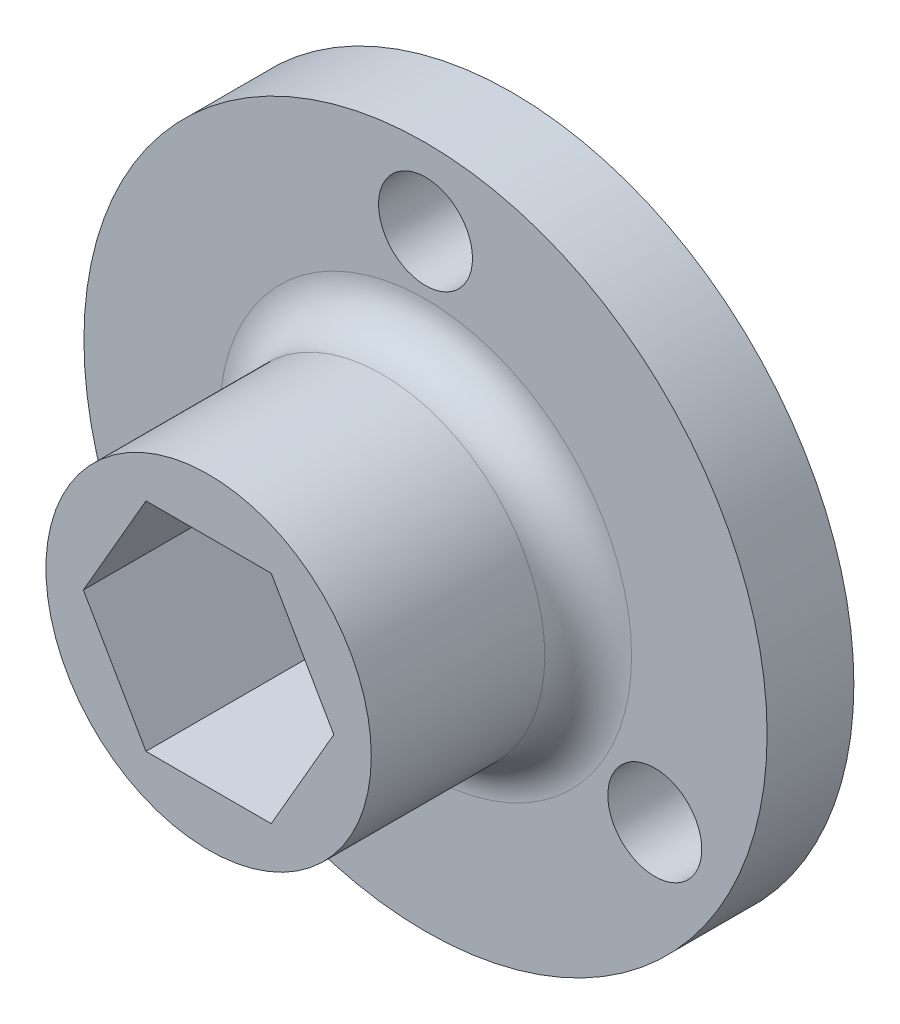
ISO-10303-21;
HEADER;
FILE_DESCRIPTION(('STEP AP214'),'2;1');
FILE_NAME('part.step','',(''),(''),'','','');
FILE_SCHEMA(('AUTOMOTIVE_DESIGN { 1 0 10303 214 1 1 1 1 }'));
ENDSEC;
DATA;
#1=APPLICATION_CONTEXT('core data for automotive mechanical design processes');
#2=APPLICATION_PROTOCOL_DEFINITION('international standard','automotive_design',2000,#1);
#3=PRODUCT_CONTEXT('',#1,'mechanical');
#4=PRODUCT('Part','Part','',(#3));
#5=PRODUCT_RELATED_PRODUCT_CATEGORY('part','',(#4));
#6=PRODUCT_DEFINITION_FORMATION('','',#4);
#7=PRODUCT_DEFINITION_CONTEXT('part definition',#1,'design');
#8=PRODUCT_DEFINITION('design','',#6,#7);
#9=PRODUCT_DEFINITION_SHAPE('','',#8);
#10=(LENGTH_UNIT() NAMED_UNIT(*) SI_UNIT(.MILLI.,.METRE.));
#11=(NAMED_UNIT(*) PLANE_ANGLE_UNIT() SI_UNIT($,.RADIAN.));
#12=(NAMED_UNIT(*) SI_UNIT($,.STERADIAN.) SOLID_ANGLE_UNIT());
#13=UNCERTAINTY_MEASURE_WITH_UNIT(LENGTH_MEASURE(1.E-05),#10,'distance_accuracy_value','');
#14=(GEOMETRIC_REPRESENTATION_CONTEXT(3) GLOBAL_UNCERTAINTY_ASSIGNED_CONTEXT((#13)) GLOBAL_UNIT_ASSIGNED_CONTEXT((#10,
#11,#12)) REPRESENTATION_CONTEXT('',''));
#15=CARTESIAN_POINT('',(0.,0.,0.));
#16=DIRECTION('',(0.,0.,1.));
#17=DIRECTION('',(1.,0.,0.));
#18=AXIS2_PLACEMENT_3D('',#15,#16,#17);
#19=CARTESIAN_POINT('',(0.,0.,5.08));
#20=DIRECTION('',(0.,0.,-1.));
#21=DIRECTION('',(-1.,0.,0.));
#22=AXIS2_PLACEMENT_3D('',#19,#20,#21);
#23=CYLINDRICAL_SURFACE('',#22,20.);
#24=CARTESIAN_POINT('',(0.,0.,5.08));
#25=DIRECTION('',(0.,0.,1.));
#26=DIRECTION('',(1.,0.,0.));
#27=AXIS2_PLACEMENT_3D('',#24,#25,#26);
#28=CIRCLE('',#27,20.);
#29=CARTESIAN_POINT('',(20.,0.,5.08));
#30=VERTEX_POINT('',#29);
#31=EDGE_CURVE('E160',#30,#30,#28,.T.);
#32=ORIENTED_EDGE('',*,*,#31,.F.);
#33=EDGE_LOOP('',(#32));
#34=FACE_BOUND('',#33,.T.);
#35=CARTESIAN_POINT('',(0.,0.,0.));
#36=DIRECTION('',(0.,0.,1.));
#37=DIRECTION('',(1.,0.,0.));
#38=AXIS2_PLACEMENT_3D('',#35,#36,#37);
#39=CIRCLE('',#38,20.);
#40=CARTESIAN_POINT('',(20.,0.,0.));
#41=VERTEX_POINT('',#40);
#42=EDGE_CURVE('E159',#41,#41,#39,.T.);
#43=ORIENTED_EDGE('',*,*,#42,.T.);
#44=EDGE_LOOP('',(#43));
#45=FACE_BOUND('',#44,.T.);
#46=ADVANCED_FACE('F33',(#34,#45),#23,.T.);
#47=CARTESIAN_POINT('',(0.,0.,5.08));
#48=DIRECTION('',(0.,0.,1.));
#49=DIRECTION('',(1.,0.,0.));
#50=AXIS2_PLACEMENT_3D('',#47,#48,#49);
#51=PLANE('',#50);
#52=CARTESIAN_POINT('',(0.,0.,5.08));
#53=DIRECTION('',(0.,0.,1.));
#54=DIRECTION('',(1.,0.,0.));
#55=AXIS2_PLACEMENT_3D('',#52,#53,#54);
#56=CIRCLE('',#55,12.065);
#57=CARTESIAN_POINT('',(12.065,0.,5.08));
#58=VERTEX_POINT('',#57);
#59=EDGE_CURVE('E11',#58,#58,#56,.F.);
#60=ORIENTED_EDGE('',*,*,#59,.T.);
#61=EDGE_LOOP('',(#60));
#62=FACE_BOUND('',#61,.T.);
#63=CARTESIAN_POINT('',(0.,15.5,5.08));
#64=DIRECTION('',(0.,0.,1.));
#65=DIRECTION('',(1.,0.,0.));
#66=AXIS2_PLACEMENT_3D('',#63,#64,#65);
#67=CIRCLE('',#66,2.75);
#68=CARTESIAN_POINT('',(2.75,15.5,5.08));
#69=VERTEX_POINT('',#68);
#70=EDGE_CURVE('E131',#69,#69,#67,.T.);
#71=ORIENTED_EDGE('',*,*,#70,.F.);
#72=EDGE_LOOP('',(#71));
#73=FACE_BOUND('',#72,.T.);
#74=CARTESIAN_POINT('',(13.4233937586588,-7.75,5.08));
#75=DIRECTION('',(0.,0.,1.));
#76=DIRECTION('',(1.,0.,0.));
#77=AXIS2_PLACEMENT_3D('',#74,#75,#76);
#78=CIRCLE('',#77,2.75);
#79=CARTESIAN_POINT('',(16.1733937586588,-7.75,5.08));
#80=VERTEX_POINT('',#79);
#81=EDGE_CURVE('E144',#80,#80,#78,.T.);
#82=ORIENTED_EDGE('',*,*,#81,.F.);
#83=EDGE_LOOP('',(#82));
#84=FACE_BOUND('',#83,.T.);
#85=CARTESIAN_POINT('',(-13.4233937586588,-7.74999999999999,5.08));
#86=DIRECTION('',(0.,0.,1.));
#87=DIRECTION('',(1.,0.,0.));
#88=AXIS2_PLACEMENT_3D('',#85,#86,#87);
#89=CIRCLE('',#88,2.75);
#90=CARTESIAN_POINT('',(-10.6733937586588,-7.74999999999999,5.08));
#91=VERTEX_POINT('',#90);
#92=EDGE_CURVE('E150',#91,#91,#89,.T.);
#93=ORIENTED_EDGE('',*,*,#92,.F.);
#94=EDGE_LOOP('',(#93));
#95=FACE_BOUND('',#94,.T.);
#96=ORIENTED_EDGE('',*,*,#31,.T.);
#97=EDGE_LOOP('',(#96));
#98=FACE_BOUND('',#97,.T.);
#99=ADVANCED_FACE('F179',(#62,#73,#84,#95,#98),#51,.T.);
#100=CARTESIAN_POINT('',(0.,0.,0.));
#101=DIRECTION('',(0.,0.,1.));
#102=DIRECTION('',(1.,0.,0.));
#103=AXIS2_PLACEMENT_3D('',#100,#101,#102);
#104=PLANE('',#103);
#105=DIRECTION('',(0.5,0.866025403784439,0.));
#106=VECTOR('',#105,1.);
#107=CARTESIAN_POINT('',(3.66617420935413,-6.35,0.));
#108=LINE('',#107,#106);
#109=CARTESIAN_POINT('',(3.66617420935413,-6.35,0.));
#110=VERTEX_POINT('',#109);
#111=CARTESIAN_POINT('',(7.33234841870825,0.,0.));
#112=VERTEX_POINT('',#111);
#113=EDGE_CURVE('E94',#110,#112,#108,.T.);
#114=ORIENTED_EDGE('',*,*,#113,.T.);
#115=DIRECTION('',(-0.5,0.866025403784439,0.));
#116=VECTOR('',#115,1.);
#117=CARTESIAN_POINT('',(7.33234841870825,0.,0.));
#118=LINE('',#117,#116);
#119=CARTESIAN_POINT('',(3.66617420935412,6.35,0.));
#120=VERTEX_POINT('',#119);
#121=EDGE_CURVE('E88',#112,#120,#118,.T.);
#122=ORIENTED_EDGE('',*,*,#121,.T.);
#123=DIRECTION('',(-1.,0.,0.));
#124=VECTOR('',#123,1.);
#125=CARTESIAN_POINT('',(3.66617420935412,6.35,0.));
#126=LINE('',#125,#124);
#127=CARTESIAN_POINT('',(-3.66617420935412,6.35,0.));
#128=VERTEX_POINT('',#127);
#129=EDGE_CURVE('E97',#120,#128,#126,.T.);
#130=ORIENTED_EDGE('',*,*,#129,.T.);
#131=DIRECTION('',(-0.5,-0.866025403784439,0.));
#132=VECTOR('',#131,1.);
#133=CARTESIAN_POINT('',(-3.66617420935412,6.35,0.));
#134=LINE('',#133,#132);
#135=CARTESIAN_POINT('',(-7.33234841870824,0.,0.));
#136=VERTEX_POINT('',#135);
#137=EDGE_CURVE('E48',#128,#136,#134,.T.);
#138=ORIENTED_EDGE('',*,*,#137,.T.);
#139=DIRECTION('',(0.5,-0.866025403784438,0.));
#140=VECTOR('',#139,1.);
#141=CARTESIAN_POINT('',(-7.33234841870824,0.,0.));
#142=LINE('',#141,#140);
#143=CARTESIAN_POINT('',(-3.66617420935412,-6.35,0.));
#144=VERTEX_POINT('',#143);
#145=EDGE_CURVE('E112',#136,#144,#142,.T.);
#146=ORIENTED_EDGE('',*,*,#145,.T.);
#147=DIRECTION('',(1.,0.,0.));
#148=VECTOR('',#147,1.);
#149=CARTESIAN_POINT('',(-3.66617420935412,-6.35,0.));
#150=LINE('',#149,#148);
#151=EDGE_CURVE('E115',#144,#110,#150,.T.);
#152=ORIENTED_EDGE('',*,*,#151,.T.);
#153=EDGE_LOOP('',(#114,#122,#130,#138,#146,#152));
#154=FACE_BOUND('',#153,.T.);
#155=CARTESIAN_POINT('',(0.,15.5,0.));
#156=DIRECTION('',(0.,0.,1.));
#157=DIRECTION('',(1.,0.,0.));
#158=AXIS2_PLACEMENT_3D('',#155,#156,#157);
#159=CIRCLE('',#158,2.75);
#160=CARTESIAN_POINT('',(2.75,15.5,0.));
#161=VERTEX_POINT('',#160);
#162=EDGE_CURVE('E141',#161,#161,#159,.T.);
#163=ORIENTED_EDGE('',*,*,#162,.T.);
#164=EDGE_LOOP('',(#163));
#165=FACE_BOUND('',#164,.T.);
#166=CARTESIAN_POINT('',(13.4233937586588,-7.75,0.));
#167=DIRECTION('',(0.,0.,1.));
#168=DIRECTION('',(1.,0.,0.));
#169=AXIS2_PLACEMENT_3D('',#166,#167,#168);
#170=CIRCLE('',#169,2.75);
#171=CARTESIAN_POINT('',(16.1733937586588,-7.75,0.));
#172=VERTEX_POINT('',#171);
#173=EDGE_CURVE('E147',#172,#172,#170,.T.);
#174=ORIENTED_EDGE('',*,*,#173,.T.);
#175=EDGE_LOOP('',(#174));
#176=FACE_BOUND('',#175,.T.);
#177=CARTESIAN_POINT('',(-13.4233937586588,-7.74999999999999,0.));
#178=DIRECTION('',(0.,0.,1.));
#179=DIRECTION('',(1.,0.,0.));
#180=AXIS2_PLACEMENT_3D('',#177,#178,#179);
#181=CIRCLE('',#180,2.75);
#182=CARTESIAN_POINT('',(-10.6733937586588,-7.74999999999999,0.));
#183=VERTEX_POINT('',#182);
#184=EDGE_CURVE('E153',#183,#183,#181,.T.);
#185=ORIENTED_EDGE('',*,*,#184,.T.);
#186=EDGE_LOOP('',(#185));
#187=FACE_BOUND('',#186,.T.);
#188=ORIENTED_EDGE('',*,*,#42,.F.);
#189=EDGE_LOOP('',(#188));
#190=FACE_BOUND('',#189,.T.);
#191=ADVANCED_FACE('F101',(#154,#165,#176,#187,#190),#104,.F.);
#192=CARTESIAN_POINT('',(0.,0.,17.78));
#193=DIRECTION('',(0.,0.,-1.));
#194=DIRECTION('',(-1.,0.,0.));
#195=AXIS2_PLACEMENT_3D('',#192,#193,#194);
#196=CYLINDRICAL_SURFACE('',#195,9.525);
#197=CARTESIAN_POINT('',(0.,0.,7.62));
#198=DIRECTION('',(0.,0.,1.));
#199=DIRECTION('',(1.,0.,0.));
#200=AXIS2_PLACEMENT_3D('',#197,#198,#199);
#201=CIRCLE('',#200,9.525);
#202=CARTESIAN_POINT('',(9.525,0.,7.62));
#203=VERTEX_POINT('',#202);
#204=EDGE_CURVE('E41',#203,#203,#201,.T.);
#205=ORIENTED_EDGE('',*,*,#204,.T.);
#206=EDGE_LOOP('',(#205));
#207=FACE_BOUND('',#206,.T.);
#208=CARTESIAN_POINT('',(0.,0.,17.78));
#209=DIRECTION('',(0.,0.,1.));
#210=DIRECTION('',(1.,0.,0.));
#211=AXIS2_PLACEMENT_3D('',#208,#209,#210);
#212=CIRCLE('',#211,9.525);
#213=CARTESIAN_POINT('',(9.525,0.,17.78));
#214=VERTEX_POINT('',#213);
#215=EDGE_CURVE('E156',#214,#214,#212,.T.);
#216=ORIENTED_EDGE('',*,*,#215,.F.);
#217=EDGE_LOOP('',(#216));
#218=FACE_BOUND('',#217,.T.);
#219=ADVANCED_FACE('F167',(#207,#218),#196,.T.);
#220=CARTESIAN_POINT('',(0.,0.,17.78));
#221=DIRECTION('',(0.,0.,1.));
#222=DIRECTION('',(1.,0.,0.));
#223=AXIS2_PLACEMENT_3D('',#220,#221,#222);
#224=PLANE('',#223);
#225=DIRECTION('',(-0.5,0.866025403784439,0.));
#226=VECTOR('',#225,1.);
#227=CARTESIAN_POINT('',(7.33234841870825,0.,17.78));
#228=LINE('',#227,#226);
#229=CARTESIAN_POINT('',(7.33234841870825,0.,17.78));
#230=VERTEX_POINT('',#229);
#231=CARTESIAN_POINT('',(3.66617420935412,6.35,17.78));
#232=VERTEX_POINT('',#231);
#233=EDGE_CURVE('E56',#230,#232,#228,.T.);
#234=ORIENTED_EDGE('',*,*,#233,.F.);
#235=DIRECTION('',(0.5,0.866025403784439,0.));
#236=VECTOR('',#235,1.);
#237=CARTESIAN_POINT('',(3.66617420935413,-6.35,17.78));
#238=LINE('',#237,#236);
#239=CARTESIAN_POINT('',(3.66617420935413,-6.35,17.78));
#240=VERTEX_POINT('',#239);
#241=EDGE_CURVE('E105',#240,#230,#238,.T.);
#242=ORIENTED_EDGE('',*,*,#241,.F.);
#243=DIRECTION('',(1.,0.,0.));
#244=VECTOR('',#243,1.);
#245=CARTESIAN_POINT('',(-3.66617420935412,-6.35,17.78));
#246=LINE('',#245,#244);
#247=CARTESIAN_POINT('',(-3.66617420935412,-6.35,17.78));
#248=VERTEX_POINT('',#247);
#249=EDGE_CURVE('E108',#248,#240,#246,.T.);
#250=ORIENTED_EDGE('',*,*,#249,.F.);
#251=DIRECTION('',(0.5,-0.866025403784438,0.));
#252=VECTOR('',#251,1.);
#253=CARTESIAN_POINT('',(-7.33234841870824,0.,17.78));
#254=LINE('',#253,#252);
#255=CARTESIAN_POINT('',(-7.33234841870824,0.,17.78));
#256=VERTEX_POINT('',#255);
#257=EDGE_CURVE('E124',#256,#248,#254,.T.);
#258=ORIENTED_EDGE('',*,*,#257,.F.);
#259=DIRECTION('',(-0.5,-0.866025403784439,0.));
#260=VECTOR('',#259,1.);
#261=CARTESIAN_POINT('',(-3.66617420935412,6.35,17.78));
#262=LINE('',#261,#260);
#263=CARTESIAN_POINT('',(-3.66617420935412,6.35,17.78));
#264=VERTEX_POINT('',#263);
#265=EDGE_CURVE('E121',#264,#256,#262,.T.);
#266=ORIENTED_EDGE('',*,*,#265,.F.);
#267=DIRECTION('',(-1.,0.,0.));
#268=VECTOR('',#267,1.);
#269=CARTESIAN_POINT('',(3.66617420935412,6.35,17.78));
#270=LINE('',#269,#268);
#271=EDGE_CURVE('E119',#232,#264,#270,.T.);
#272=ORIENTED_EDGE('',*,*,#271,.F.);
#273=EDGE_LOOP('',(#234,#242,#250,#258,#266,#272));
#274=FACE_BOUND('',#273,.T.);
#275=ORIENTED_EDGE('',*,*,#215,.T.);
#276=EDGE_LOOP('',(#275));
#277=FACE_BOUND('',#276,.T.);
#278=ADVANCED_FACE('F193',(#274,#277),#224,.T.);
#279=CARTESIAN_POINT('',(-13.4233937586588,-7.74999999999999,5.08));
#280=DIRECTION('',(0.,0.,1.));
#281=DIRECTION('',(1.,0.,0.));
#282=AXIS2_PLACEMENT_3D('',#279,#280,#281);
#283=CYLINDRICAL_SURFACE('',#282,2.75);
#284=ORIENTED_EDGE('',*,*,#184,.F.);
#285=EDGE_LOOP('',(#284));
#286=FACE_BOUND('',#285,.T.);
#287=ORIENTED_EDGE('',*,*,#92,.T.);
#288=EDGE_LOOP('',(#287));
#289=FACE_BOUND('',#288,.T.);
#290=ADVANCED_FACE('F196',(#286,#289),#283,.F.);
#291=CARTESIAN_POINT('',(13.4233937586588,-7.75,5.08));
#292=DIRECTION('',(0.,0.,1.));
#293=DIRECTION('',(1.,0.,0.));
#294=AXIS2_PLACEMENT_3D('',#291,#292,#293);
#295=CYLINDRICAL_SURFACE('',#294,2.75);
#296=ORIENTED_EDGE('',*,*,#173,.F.);
#297=EDGE_LOOP('',(#296));
#298=FACE_BOUND('',#297,.T.);
#299=ORIENTED_EDGE('',*,*,#81,.T.);
#300=EDGE_LOOP('',(#299));
#301=FACE_BOUND('',#300,.T.);
#302=ADVANCED_FACE('F200',(#298,#301),#295,.F.);
#303=CARTESIAN_POINT('',(0.,15.5,5.08));
#304=DIRECTION('',(0.,0.,1.));
#305=DIRECTION('',(1.,0.,0.));
#306=AXIS2_PLACEMENT_3D('',#303,#304,#305);
#307=CYLINDRICAL_SURFACE('',#306,2.75);
#308=ORIENTED_EDGE('',*,*,#162,.F.);
#309=EDGE_LOOP('',(#308));
#310=FACE_BOUND('',#309,.T.);
#311=ORIENTED_EDGE('',*,*,#70,.T.);
#312=EDGE_LOOP('',(#311));
#313=FACE_BOUND('',#312,.T.);
#314=ADVANCED_FACE('F204',(#310,#313),#307,.F.);
#315=CARTESIAN_POINT('',(7.33234841870825,0.,0.));
#316=DIRECTION('',(0.866025403784439,0.5,0.));
#317=DIRECTION('',(-0.5,0.866025403784439,0.));
#318=AXIS2_PLACEMENT_3D('',#315,#316,#317);
#319=PLANE('',#318);
#320=ORIENTED_EDGE('',*,*,#233,.T.);
#321=DIRECTION('',(0.,0.,1.));
#322=VECTOR('',#321,1.);
#323=CARTESIAN_POINT('',(3.66617420935412,6.35,0.));
#324=LINE('',#323,#322);
#325=EDGE_CURVE('E84',#120,#232,#324,.T.);
#326=ORIENTED_EDGE('',*,*,#325,.F.);
#327=ORIENTED_EDGE('',*,*,#121,.F.);
#328=DIRECTION('',(0.,0.,1.));
#329=VECTOR('',#328,1.);
#330=CARTESIAN_POINT('',(7.33234841870825,0.,0.));
#331=LINE('',#330,#329);
#332=EDGE_CURVE('E129',#112,#230,#331,.T.);
#333=ORIENTED_EDGE('',*,*,#332,.T.);
#334=EDGE_LOOP('',(#320,#326,#327,#333));
#335=FACE_BOUND('',#334,.T.);
#336=ADVANCED_FACE('F86',(#335),#319,.F.);
#337=CARTESIAN_POINT('',(3.66617420935413,-6.35,0.));
#338=DIRECTION('',(0.866025403784439,-0.5,0.));
#339=DIRECTION('',(0.5,0.866025403784439,0.));
#340=AXIS2_PLACEMENT_3D('',#337,#338,#339);
#341=PLANE('',#340);
#342=ORIENTED_EDGE('',*,*,#241,.T.);
#343=ORIENTED_EDGE('',*,*,#332,.F.);
#344=ORIENTED_EDGE('',*,*,#113,.F.);
#345=DIRECTION('',(0.,0.,1.));
#346=VECTOR('',#345,1.);
#347=CARTESIAN_POINT('',(3.66617420935413,-6.35,0.));
#348=LINE('',#347,#346);
#349=EDGE_CURVE('E132',#110,#240,#348,.T.);
#350=ORIENTED_EDGE('',*,*,#349,.T.);
#351=EDGE_LOOP('',(#342,#343,#344,#350));
#352=FACE_BOUND('',#351,.T.);
#353=ADVANCED_FACE('F210',(#352),#341,.F.);
#354=CARTESIAN_POINT('',(-3.66617420935412,-6.35,0.));
#355=DIRECTION('',(0.,-1.,0.));
#356=DIRECTION('',(1.,0.,0.));
#357=AXIS2_PLACEMENT_3D('',#354,#355,#356);
#358=PLANE('',#357);
#359=ORIENTED_EDGE('',*,*,#249,.T.);
#360=ORIENTED_EDGE('',*,*,#349,.F.);
#361=ORIENTED_EDGE('',*,*,#151,.F.);
#362=DIRECTION('',(0.,0.,1.));
#363=VECTOR('',#362,1.);
#364=CARTESIAN_POINT('',(-3.66617420935412,-6.35,0.));
#365=LINE('',#364,#363);
#366=EDGE_CURVE('E134',#144,#248,#365,.T.);
#367=ORIENTED_EDGE('',*,*,#366,.T.);
#368=EDGE_LOOP('',(#359,#360,#361,#367));
#369=FACE_BOUND('',#368,.T.);
#370=ADVANCED_FACE('F217',(#369),#358,.F.);
#371=CARTESIAN_POINT('',(-7.33234841870824,0.,0.));
#372=DIRECTION('',(-0.866025403784438,-0.5,0.));
#373=DIRECTION('',(0.5,-0.866025403784439,0.));
#374=AXIS2_PLACEMENT_3D('',#371,#372,#373);
#375=PLANE('',#374);
#376=ORIENTED_EDGE('',*,*,#257,.T.);
#377=ORIENTED_EDGE('',*,*,#366,.F.);
#378=ORIENTED_EDGE('',*,*,#145,.F.);
#379=DIRECTION('',(0.,0.,1.));
#380=VECTOR('',#379,1.);
#381=CARTESIAN_POINT('',(-7.33234841870824,0.,0.));
#382=LINE('',#381,#380);
#383=EDGE_CURVE('E136',#136,#256,#382,.T.);
#384=ORIENTED_EDGE('',*,*,#383,.T.);
#385=EDGE_LOOP('',(#376,#377,#378,#384));
#386=FACE_BOUND('',#385,.T.);
#387=ADVANCED_FACE('F214',(#386),#375,.F.);
#388=CARTESIAN_POINT('',(-3.66617420935412,6.35,0.));
#389=DIRECTION('',(-0.866025403784439,0.5,0.));
#390=DIRECTION('',(-0.5,-0.866025403784439,0.));
#391=AXIS2_PLACEMENT_3D('',#388,#389,#390);
#392=PLANE('',#391);
#393=ORIENTED_EDGE('',*,*,#265,.T.);
#394=ORIENTED_EDGE('',*,*,#383,.F.);
#395=ORIENTED_EDGE('',*,*,#137,.F.);
#396=DIRECTION('',(0.,0.,1.));
#397=VECTOR('',#396,1.);
#398=CARTESIAN_POINT('',(-3.66617420935412,6.35,0.));
#399=LINE('',#398,#397);
#400=EDGE_CURVE('E93',#128,#264,#399,.T.);
#401=ORIENTED_EDGE('',*,*,#400,.T.);
#402=EDGE_LOOP('',(#393,#394,#395,#401));
#403=FACE_BOUND('',#402,.T.);
#404=ADVANCED_FACE('F175',(#403),#392,.F.);
#405=CARTESIAN_POINT('',(3.66617420935412,6.35,0.));
#406=DIRECTION('',(0.,1.,0.));
#407=DIRECTION('',(-1.,0.,0.));
#408=AXIS2_PLACEMENT_3D('',#405,#406,#407);
#409=PLANE('',#408);
#410=ORIENTED_EDGE('',*,*,#271,.T.);
#411=ORIENTED_EDGE('',*,*,#400,.F.);
#412=ORIENTED_EDGE('',*,*,#129,.F.);
#413=ORIENTED_EDGE('',*,*,#325,.T.);
#414=EDGE_LOOP('',(#410,#411,#412,#413));
#415=FACE_BOUND('',#414,.T.);
#416=ADVANCED_FACE('F98',(#415),#409,.F.);
#417=CARTESIAN_POINT('',(0.,0.,7.62));
#418=DIRECTION('',(0.,0.,1.));
#419=DIRECTION('',(1.,0.,0.));
#420=AXIS2_PLACEMENT_3D('',#417,#418,#419);
#421=TOROIDAL_SURFACE('',#420,12.065,2.54);
#422=ORIENTED_EDGE('',*,*,#59,.F.);
#423=EDGE_LOOP('',(#422));
#424=FACE_BOUND('',#423,.T.);
#425=ORIENTED_EDGE('',*,*,#204,.F.);
#426=EDGE_LOOP('',(#425));
#427=FACE_BOUND('',#426,.T.);
#428=ADVANCED_FACE('F35',(#424,#427),#421,.F.);
#429=CLOSED_SHELL('',(#46,#99,#191,#219,#278,#290,#302,#314,#336,#353,#370,#387,#404,#416,#428));
#430=MANIFOLD_SOLID_BREP('B2',#429);
#431=ADVANCED_BREP_SHAPE_REPRESENTATION('',(#18,#430),#14);
#432=SHAPE_DEFINITION_REPRESENTATION(#9,#431);
ENDSEC;
END-ISO-10303-21;
